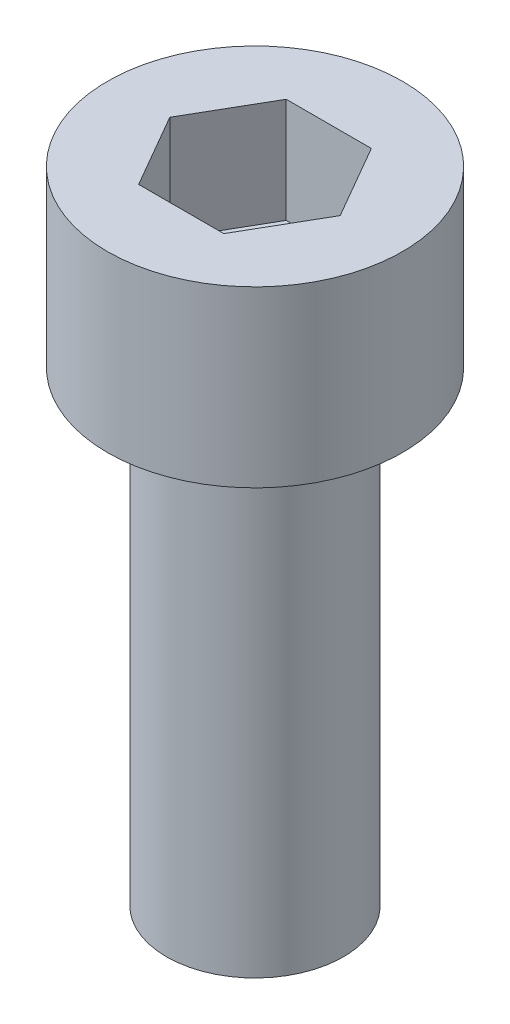
ISO-10303-21;
HEADER;
FILE_DESCRIPTION(('STEP AP214'),'2;1');
FILE_NAME('part.step','',(''),(''),'','','');
FILE_SCHEMA(('AUTOMOTIVE_DESIGN { 1 0 10303 214 1 1 1 1 }'));
ENDSEC;
DATA;
#1=APPLICATION_CONTEXT('core data for automotive mechanical design processes');
#2=APPLICATION_PROTOCOL_DEFINITION('international standard','automotive_design',2000,#1);
#3=PRODUCT_CONTEXT('',#1,'mechanical');
#4=PRODUCT('Part','Part','',(#3));
#5=PRODUCT_RELATED_PRODUCT_CATEGORY('part','',(#4));
#6=PRODUCT_DEFINITION_FORMATION('','',#4);
#7=PRODUCT_DEFINITION_CONTEXT('part definition',#1,'design');
#8=PRODUCT_DEFINITION('design','',#6,#7);
#9=PRODUCT_DEFINITION_SHAPE('','',#8);
#10=(LENGTH_UNIT() NAMED_UNIT(*) SI_UNIT(.MILLI.,.METRE.));
#11=(NAMED_UNIT(*) PLANE_ANGLE_UNIT() SI_UNIT($,.RADIAN.));
#12=(NAMED_UNIT(*) SI_UNIT($,.STERADIAN.) SOLID_ANGLE_UNIT());
#13=UNCERTAINTY_MEASURE_WITH_UNIT(LENGTH_MEASURE(1.E-05),#10,'distance_accuracy_value','');
#14=(GEOMETRIC_REPRESENTATION_CONTEXT(3) GLOBAL_UNCERTAINTY_ASSIGNED_CONTEXT((#13)) GLOBAL_UNIT_ASSIGNED_CONTEXT((#10,
#11,#12)) REPRESENTATION_CONTEXT('',''));
#15=CARTESIAN_POINT('',(0.,0.,0.));
#16=DIRECTION('',(0.,0.,1.));
#17=DIRECTION('',(1.,0.,0.));
#18=AXIS2_PLACEMENT_3D('',#15,#16,#17);
#19=CARTESIAN_POINT('',(0.,7.9,0.));
#20=DIRECTION('',(0.,-1.,0.));
#21=DIRECTION('',(0.,0.,-1.));
#22=AXIS2_PLACEMENT_3D('',#19,#20,#21);
#23=CYLINDRICAL_SURFACE('',#22,1.5);
#24=CARTESIAN_POINT('',(0.,7.9,0.));
#25=DIRECTION('',(0.,1.,0.));
#26=DIRECTION('',(0.,0.,1.));
#27=AXIS2_PLACEMENT_3D('',#24,#25,#26);
#28=CIRCLE('',#27,1.5);
#29=CARTESIAN_POINT('',(0.,7.9,1.5));
#30=VERTEX_POINT('',#29);
#31=EDGE_CURVE('E11',#30,#30,#28,.T.);
#32=ORIENTED_EDGE('',*,*,#31,.F.);
#33=EDGE_LOOP('',(#32));
#34=FACE_BOUND('',#33,.T.);
#35=CARTESIAN_POINT('',(0.,0.,0.));
#36=DIRECTION('',(0.,1.,0.));
#37=DIRECTION('',(0.,0.,1.));
#38=AXIS2_PLACEMENT_3D('',#35,#36,#37);
#39=CIRCLE('',#38,1.5);
#40=CARTESIAN_POINT('',(0.,0.,1.5));
#41=VERTEX_POINT('',#40);
#42=EDGE_CURVE('E50',#41,#41,#39,.T.);
#43=ORIENTED_EDGE('',*,*,#42,.T.);
#44=EDGE_LOOP('',(#43));
#45=FACE_BOUND('',#44,.T.);
#46=ADVANCED_FACE('F47',(#34,#45),#23,.T.);
#47=CARTESIAN_POINT('',(0.,0.,0.));
#48=DIRECTION('',(0.,1.,0.));
#49=DIRECTION('',(0.,0.,1.));
#50=AXIS2_PLACEMENT_3D('',#47,#48,#49);
#51=PLANE('',#50);
#52=ORIENTED_EDGE('',*,*,#42,.F.);
#53=EDGE_LOOP('',(#52));
#54=FACE_BOUND('',#53,.T.);
#55=ADVANCED_FACE('F184',(#54),#51,.F.);
#56=CARTESIAN_POINT('',(0.,10.85,0.));
#57=DIRECTION('',(0.,1.,0.));
#58=DIRECTION('',(0.,0.,1.));
#59=AXIS2_PLACEMENT_3D('',#56,#57,#58);
#60=PLANE('',#59);
#61=DIRECTION('',(0.5,0.,-0.866025403784439));
#62=VECTOR('',#61,1.);
#63=CARTESIAN_POINT('',(0.721687836487033,10.85,1.25));
#64=LINE('',#63,#62);
#65=CARTESIAN_POINT('',(0.721687836487033,10.85,1.25));
#66=VERTEX_POINT('',#65);
#67=CARTESIAN_POINT('',(1.44337567297406,10.85,0.));
#68=VERTEX_POINT('',#67);
#69=EDGE_CURVE('E62',#66,#68,#64,.T.);
#70=ORIENTED_EDGE('',*,*,#69,.F.);
#71=DIRECTION('',(1.,0.,0.));
#72=VECTOR('',#71,1.);
#73=CARTESIAN_POINT('',(-0.721687836487032,10.85,1.25));
#74=LINE('',#73,#72);
#75=CARTESIAN_POINT('',(-0.721687836487032,10.85,1.25));
#76=VERTEX_POINT('',#75);
#77=EDGE_CURVE('E155',#76,#66,#74,.T.);
#78=ORIENTED_EDGE('',*,*,#77,.F.);
#79=DIRECTION('',(0.5,0.,0.866025403784438));
#80=VECTOR('',#79,1.);
#81=CARTESIAN_POINT('',(-1.44337567297406,10.85,0.));
#82=LINE('',#81,#80);
#83=CARTESIAN_POINT('',(-1.44337567297406,10.85,0.));
#84=VERTEX_POINT('',#83);
#85=EDGE_CURVE('E152',#84,#76,#82,.T.);
#86=ORIENTED_EDGE('',*,*,#85,.F.);
#87=DIRECTION('',(-0.5,0.,0.866025403784439));
#88=VECTOR('',#87,1.);
#89=CARTESIAN_POINT('',(-0.721687836487032,10.85,-1.25));
#90=LINE('',#89,#88);
#91=CARTESIAN_POINT('',(-0.721687836487032,10.85,-1.25));
#92=VERTEX_POINT('',#91);
#93=EDGE_CURVE('E110',#92,#84,#90,.T.);
#94=ORIENTED_EDGE('',*,*,#93,.F.);
#95=DIRECTION('',(-1.,0.,0.));
#96=VECTOR('',#95,1.);
#97=CARTESIAN_POINT('',(0.721687836487032,10.85,-1.25));
#98=LINE('',#97,#96);
#99=CARTESIAN_POINT('',(0.721687836487032,10.85,-1.25));
#100=VERTEX_POINT('',#99);
#101=EDGE_CURVE('E146',#100,#92,#98,.T.);
#102=ORIENTED_EDGE('',*,*,#101,.F.);
#103=DIRECTION('',(-0.5,0.,-0.866025403784438));
#104=VECTOR('',#103,1.);
#105=CARTESIAN_POINT('',(1.44337567297406,10.85,0.));
#106=LINE('',#105,#104);
#107=EDGE_CURVE('E142',#68,#100,#106,.T.);
#108=ORIENTED_EDGE('',*,*,#107,.F.);
#109=EDGE_LOOP('',(#70,#78,#86,#94,#102,#108));
#110=FACE_BOUND('',#109,.T.);
#111=CARTESIAN_POINT('',(0.,10.85,0.));
#112=DIRECTION('',(0.,-1.,0.));
#113=DIRECTION('',(0.,0.,-1.));
#114=AXIS2_PLACEMENT_3D('',#111,#112,#113);
#115=CIRCLE('',#114,2.5);
#116=CARTESIAN_POINT('',(0.,10.85,-2.5));
#117=VERTEX_POINT('',#116);
#118=EDGE_CURVE('E174',#117,#117,#115,.T.);
#119=ORIENTED_EDGE('',*,*,#118,.F.);
#120=EDGE_LOOP('',(#119));
#121=FACE_BOUND('',#120,.T.);
#122=ADVANCED_FACE('F186',(#110,#121),#60,.T.);
#123=CARTESIAN_POINT('',(0.,7.9,0.));
#124=DIRECTION('',(0.,-1.,0.));
#125=DIRECTION('',(0.,0.,-1.));
#126=AXIS2_PLACEMENT_3D('',#123,#124,#125);
#127=CYLINDRICAL_SURFACE('',#126,2.5);
#128=ORIENTED_EDGE('',*,*,#118,.T.);
#129=EDGE_LOOP('',(#128));
#130=FACE_BOUND('',#129,.T.);
#131=CARTESIAN_POINT('',(0.,7.9,0.));
#132=DIRECTION('',(0.,-1.,0.));
#133=DIRECTION('',(0.,0.,-1.));
#134=AXIS2_PLACEMENT_3D('',#131,#132,#133);
#135=CIRCLE('',#134,2.5);
#136=CARTESIAN_POINT('',(0.,7.9,-2.5));
#137=VERTEX_POINT('',#136);
#138=EDGE_CURVE('E161',#137,#137,#135,.T.);
#139=ORIENTED_EDGE('',*,*,#138,.F.);
#140=EDGE_LOOP('',(#139));
#141=FACE_BOUND('',#140,.T.);
#142=ADVANCED_FACE('F191',(#130,#141),#127,.T.);
#143=CARTESIAN_POINT('',(0.,7.9,0.));
#144=DIRECTION('',(0.,-1.,0.));
#145=DIRECTION('',(0.,0.,-1.));
#146=AXIS2_PLACEMENT_3D('',#143,#144,#145);
#147=PLANE('',#146);
#148=ORIENTED_EDGE('',*,*,#31,.T.);
#149=EDGE_LOOP('',(#148));
#150=FACE_BOUND('',#149,.T.);
#151=ORIENTED_EDGE('',*,*,#138,.T.);
#152=EDGE_LOOP('',(#151));
#153=FACE_BOUND('',#152,.T.);
#154=ADVANCED_FACE('F198',(#150,#153),#147,.T.);
#155=CARTESIAN_POINT('',(0.721687836487033,9.072,1.25));
#156=DIRECTION('',(0.866025403784439,0.,0.5));
#157=DIRECTION('',(0.5,0.,-0.866025403784439));
#158=AXIS2_PLACEMENT_3D('',#155,#156,#157);
#159=PLANE('',#158);
#160=ORIENTED_EDGE('',*,*,#69,.T.);
#161=DIRECTION('',(0.,1.,0.));
#162=VECTOR('',#161,1.);
#163=CARTESIAN_POINT('',(1.44337567297407,9.072,0.));
#164=LINE('',#163,#162);
#165=CARTESIAN_POINT('',(1.44337567297407,9.072,0.));
#166=VERTEX_POINT('',#165);
#167=EDGE_CURVE('E92',#166,#68,#164,.T.);
#168=ORIENTED_EDGE('',*,*,#167,.F.);
#169=DIRECTION('',(0.5,0.,-0.866025403784439));
#170=VECTOR('',#169,1.);
#171=CARTESIAN_POINT('',(0.721687836487033,9.072,1.25));
#172=LINE('',#171,#170);
#173=CARTESIAN_POINT('',(0.721687836487033,9.072,1.25));
#174=VERTEX_POINT('',#173);
#175=EDGE_CURVE('E158',#174,#166,#172,.T.);
#176=ORIENTED_EDGE('',*,*,#175,.F.);
#177=DIRECTION('',(0.,1.,0.));
#178=VECTOR('',#177,1.);
#179=CARTESIAN_POINT('',(0.721687836487033,9.072,1.25));
#180=LINE('',#179,#178);
#181=EDGE_CURVE('E70',#174,#66,#180,.T.);
#182=ORIENTED_EDGE('',*,*,#181,.T.);
#183=EDGE_LOOP('',(#160,#168,#176,#182));
#184=FACE_BOUND('',#183,.T.);
#185=ADVANCED_FACE('F201',(#184),#159,.F.);
#186=CARTESIAN_POINT('',(-0.721687836487032,9.072,1.25));
#187=DIRECTION('',(0.,0.,1.));
#188=DIRECTION('',(1.,0.,0.));
#189=AXIS2_PLACEMENT_3D('',#186,#187,#188);
#190=PLANE('',#189);
#191=ORIENTED_EDGE('',*,*,#77,.T.);
#192=ORIENTED_EDGE('',*,*,#181,.F.);
#193=DIRECTION('',(1.,0.,0.));
#194=VECTOR('',#193,1.);
#195=CARTESIAN_POINT('',(-0.721687836487032,9.072,1.25));
#196=LINE('',#195,#194);
#197=CARTESIAN_POINT('',(-0.721687836487032,9.072,1.25));
#198=VERTEX_POINT('',#197);
#199=EDGE_CURVE('E124',#198,#174,#196,.T.);
#200=ORIENTED_EDGE('',*,*,#199,.F.);
#201=DIRECTION('',(0.,1.,0.));
#202=VECTOR('',#201,1.);
#203=CARTESIAN_POINT('',(-0.721687836487032,9.072,1.25));
#204=LINE('',#203,#202);
#205=EDGE_CURVE('E115',#198,#76,#204,.T.);
#206=ORIENTED_EDGE('',*,*,#205,.T.);
#207=EDGE_LOOP('',(#191,#192,#200,#206));
#208=FACE_BOUND('',#207,.T.);
#209=ADVANCED_FACE('F205',(#208),#190,.F.);
#210=CARTESIAN_POINT('',(-1.44337567297406,9.072,0.));
#211=DIRECTION('',(-0.866025403784438,0.,0.5));
#212=DIRECTION('',(0.5,0.,0.866025403784439));
#213=AXIS2_PLACEMENT_3D('',#210,#211,#212);
#214=PLANE('',#213);
#215=ORIENTED_EDGE('',*,*,#85,.T.);
#216=ORIENTED_EDGE('',*,*,#205,.F.);
#217=DIRECTION('',(0.5,0.,0.866025403784438));
#218=VECTOR('',#217,1.);
#219=CARTESIAN_POINT('',(-1.44337567297406,9.072,0.));
#220=LINE('',#219,#218);
#221=CARTESIAN_POINT('',(-1.44337567297406,9.072,0.));
#222=VERTEX_POINT('',#221);
#223=EDGE_CURVE('E119',#222,#198,#220,.T.);
#224=ORIENTED_EDGE('',*,*,#223,.F.);
#225=DIRECTION('',(0.,1.,0.));
#226=VECTOR('',#225,1.);
#227=CARTESIAN_POINT('',(-1.44337567297406,9.072,0.));
#228=LINE('',#227,#226);
#229=EDGE_CURVE('E103',#222,#84,#228,.T.);
#230=ORIENTED_EDGE('',*,*,#229,.T.);
#231=EDGE_LOOP('',(#215,#216,#224,#230));
#232=FACE_BOUND('',#231,.T.);
#233=ADVANCED_FACE('F120',(#232),#214,.F.);
#234=CARTESIAN_POINT('',(-0.721687836487032,9.072,-1.25));
#235=DIRECTION('',(-0.866025403784439,0.,-0.5));
#236=DIRECTION('',(-0.5,0.,0.866025403784439));
#237=AXIS2_PLACEMENT_3D('',#234,#235,#236);
#238=PLANE('',#237);
#239=ORIENTED_EDGE('',*,*,#93,.T.);
#240=ORIENTED_EDGE('',*,*,#229,.F.);
#241=DIRECTION('',(-0.5,0.,0.866025403784439));
#242=VECTOR('',#241,1.);
#243=CARTESIAN_POINT('',(-0.721687836487032,9.072,-1.25));
#244=LINE('',#243,#242);
#245=CARTESIAN_POINT('',(-0.721687836487032,9.072,-1.25));
#246=VERTEX_POINT('',#245);
#247=EDGE_CURVE('E107',#246,#222,#244,.T.);
#248=ORIENTED_EDGE('',*,*,#247,.F.);
#249=DIRECTION('',(0.,1.,0.));
#250=VECTOR('',#249,1.);
#251=CARTESIAN_POINT('',(-0.721687836487032,9.072,-1.25));
#252=LINE('',#251,#250);
#253=EDGE_CURVE('E116',#246,#92,#252,.T.);
#254=ORIENTED_EDGE('',*,*,#253,.T.);
#255=EDGE_LOOP('',(#239,#240,#248,#254));
#256=FACE_BOUND('',#255,.T.);
#257=ADVANCED_FACE('F105',(#256),#238,.F.);
#258=CARTESIAN_POINT('',(0.721687836487032,9.072,-1.25));
#259=DIRECTION('',(0.,0.,-1.));
#260=DIRECTION('',(-1.,0.,0.));
#261=AXIS2_PLACEMENT_3D('',#258,#259,#260);
#262=PLANE('',#261);
#263=ORIENTED_EDGE('',*,*,#101,.T.);
#264=ORIENTED_EDGE('',*,*,#253,.F.);
#265=DIRECTION('',(-1.,0.,0.));
#266=VECTOR('',#265,1.);
#267=CARTESIAN_POINT('',(0.721687836487032,9.072,-1.25));
#268=LINE('',#267,#266);
#269=CARTESIAN_POINT('',(0.721687836487032,9.072,-1.25));
#270=VERTEX_POINT('',#269);
#271=EDGE_CURVE('E130',#270,#246,#268,.T.);
#272=ORIENTED_EDGE('',*,*,#271,.F.);
#273=DIRECTION('',(0.,1.,0.));
#274=VECTOR('',#273,1.);
#275=CARTESIAN_POINT('',(0.721687836487032,9.072,-1.25));
#276=LINE('',#275,#274);
#277=EDGE_CURVE('E166',#270,#100,#276,.T.);
#278=ORIENTED_EDGE('',*,*,#277,.T.);
#279=EDGE_LOOP('',(#263,#264,#272,#278));
#280=FACE_BOUND('',#279,.T.);
#281=ADVANCED_FACE('F209',(#280),#262,.F.);
#282=CARTESIAN_POINT('',(1.44337567297407,9.072,0.));
#283=DIRECTION('',(0.866025403784439,0.,-0.5));
#284=DIRECTION('',(-0.5,0.,-0.866025403784439));
#285=AXIS2_PLACEMENT_3D('',#282,#283,#284);
#286=PLANE('',#285);
#287=ORIENTED_EDGE('',*,*,#107,.T.);
#288=ORIENTED_EDGE('',*,*,#277,.F.);
#289=DIRECTION('',(-0.5,0.,-0.866025403784438));
#290=VECTOR('',#289,1.);
#291=CARTESIAN_POINT('',(1.44337567297407,9.072,0.));
#292=LINE('',#291,#290);
#293=EDGE_CURVE('E134',#166,#270,#292,.T.);
#294=ORIENTED_EDGE('',*,*,#293,.F.);
#295=ORIENTED_EDGE('',*,*,#167,.T.);
#296=EDGE_LOOP('',(#287,#288,#294,#295));
#297=FACE_BOUND('',#296,.T.);
#298=ADVANCED_FACE('F206',(#297),#286,.F.);
#299=CARTESIAN_POINT('',(0.,9.072,0.));
#300=DIRECTION('',(0.,1.,0.));
#301=DIRECTION('',(0.,0.,1.));
#302=AXIS2_PLACEMENT_3D('',#299,#300,#301);
#303=PLANE('',#302);
#304=ORIENTED_EDGE('',*,*,#175,.T.);
#305=ORIENTED_EDGE('',*,*,#293,.T.);
#306=ORIENTED_EDGE('',*,*,#271,.T.);
#307=ORIENTED_EDGE('',*,*,#247,.T.);
#308=ORIENTED_EDGE('',*,*,#223,.T.);
#309=ORIENTED_EDGE('',*,*,#199,.T.);
#310=EDGE_LOOP('',(#304,#305,#306,#307,#308,#309));
#311=FACE_BOUND('',#310,.T.);
#312=ADVANCED_FACE('F127',(#311),#303,.T.);
#313=CLOSED_SHELL('',(#46,#55,#122,#142,#154,#185,#209,#233,#257,#281,#298,#312));
#314=MANIFOLD_SOLID_BREP('B2',#313);
#315=ADVANCED_BREP_SHAPE_REPRESENTATION('',(#18,#314),#14);
#316=SHAPE_DEFINITION_REPRESENTATION(#9,#315);
ENDSEC;
END-ISO-10303-21;
